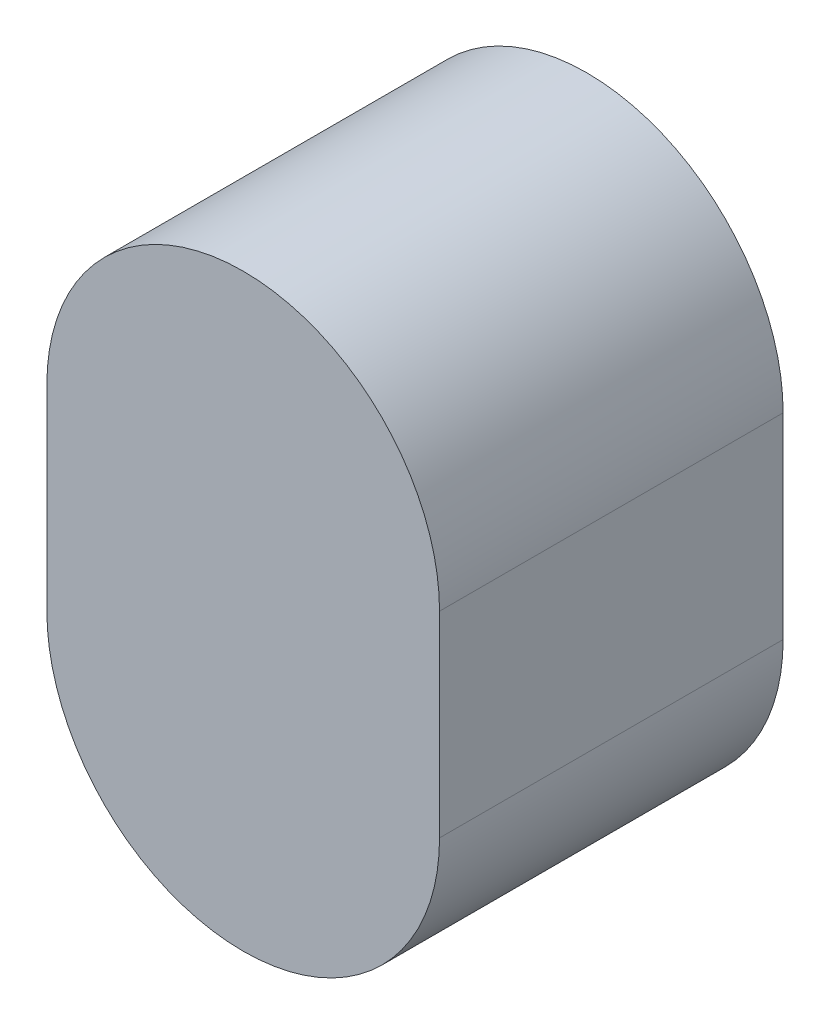
ISO-10303-21;
HEADER;
FILE_DESCRIPTION(('STEP AP214'),'2;1');
FILE_NAME('part.step','',(''),(''),'','','');
FILE_SCHEMA(('AUTOMOTIVE_DESIGN { 1 0 10303 214 1 1 1 1 }'));
ENDSEC;
DATA;
#1=APPLICATION_CONTEXT('core data for automotive mechanical design processes');
#2=APPLICATION_PROTOCOL_DEFINITION('international standard','automotive_design',2000,#1);
#3=PRODUCT_CONTEXT('',#1,'mechanical');
#4=PRODUCT('Part','Part','',(#3));
#5=PRODUCT_RELATED_PRODUCT_CATEGORY('part','',(#4));
#6=PRODUCT_DEFINITION_FORMATION('','',#4);
#7=PRODUCT_DEFINITION_CONTEXT('part definition',#1,'design');
#8=PRODUCT_DEFINITION('design','',#6,#7);
#9=PRODUCT_DEFINITION_SHAPE('','',#8);
#10=(LENGTH_UNIT() NAMED_UNIT(*) SI_UNIT(.MILLI.,.METRE.));
#11=(NAMED_UNIT(*) PLANE_ANGLE_UNIT() SI_UNIT($,.RADIAN.));
#12=(NAMED_UNIT(*) SI_UNIT($,.STERADIAN.) SOLID_ANGLE_UNIT());
#13=UNCERTAINTY_MEASURE_WITH_UNIT(LENGTH_MEASURE(1.E-05),#10,'distance_accuracy_value','');
#14=(GEOMETRIC_REPRESENTATION_CONTEXT(3) GLOBAL_UNCERTAINTY_ASSIGNED_CONTEXT((#13)) GLOBAL_UNIT_ASSIGNED_CONTEXT((#10,
#11,#12)) REPRESENTATION_CONTEXT('',''));
#15=CARTESIAN_POINT('',(0.,0.,0.));
#16=DIRECTION('',(0.,0.,1.));
#17=DIRECTION('',(1.,0.,0.));
#18=AXIS2_PLACEMENT_3D('',#15,#16,#17);
#19=CARTESIAN_POINT('',(4.,0.,7.));
#20=DIRECTION('',(1.,0.,0.));
#21=DIRECTION('',(0.,0.,-1.));
#22=AXIS2_PLACEMENT_3D('',#19,#20,#21);
#23=PLANE('',#22);
#24=DIRECTION('',(0.,-1.,0.));
#25=VECTOR('',#24,1.);
#26=CARTESIAN_POINT('',(4.,0.,0.));
#27=LINE('',#26,#25);
#28=CARTESIAN_POINT('',(4.,0.,0.));
#29=VERTEX_POINT('',#28);
#30=CARTESIAN_POINT('',(4.,-4.,0.));
#31=VERTEX_POINT('',#30);
#32=EDGE_CURVE('E98',#29,#31,#27,.T.);
#33=ORIENTED_EDGE('',*,*,#32,.F.);
#34=DIRECTION('',(0.,0.,-1.));
#35=VECTOR('',#34,1.);
#36=CARTESIAN_POINT('',(4.,0.,7.));
#37=LINE('',#36,#35);
#38=CARTESIAN_POINT('',(4.,0.,7.));
#39=VERTEX_POINT('',#38);
#40=EDGE_CURVE('E11',#39,#29,#37,.T.);
#41=ORIENTED_EDGE('',*,*,#40,.F.);
#42=DIRECTION('',(0.,-1.,0.));
#43=VECTOR('',#42,1.);
#44=CARTESIAN_POINT('',(4.,0.,7.));
#45=LINE('',#44,#43);
#46=CARTESIAN_POINT('',(4.,-4.,7.));
#47=VERTEX_POINT('',#46);
#48=EDGE_CURVE('E93',#39,#47,#45,.T.);
#49=ORIENTED_EDGE('',*,*,#48,.T.);
#50=DIRECTION('',(0.,0.,-1.));
#51=VECTOR('',#50,1.);
#52=CARTESIAN_POINT('',(4.,-4.,7.));
#53=LINE('',#52,#51);
#54=EDGE_CURVE('E36',#47,#31,#53,.T.);
#55=ORIENTED_EDGE('',*,*,#54,.T.);
#56=EDGE_LOOP('',(#33,#41,#49,#55));
#57=FACE_BOUND('',#56,.T.);
#58=ADVANCED_FACE('F33',(#57),#23,.T.);
#59=CARTESIAN_POINT('',(0.,0.,7.));
#60=DIRECTION('',(0.,0.,-1.));
#61=DIRECTION('',(-1.,0.,0.));
#62=AXIS2_PLACEMENT_3D('',#59,#60,#61);
#63=CYLINDRICAL_SURFACE('',#62,4.);
#64=CARTESIAN_POINT('',(0.,0.,0.));
#65=DIRECTION('',(0.,0.,1.));
#66=DIRECTION('',(1.,0.,0.));
#67=AXIS2_PLACEMENT_3D('',#64,#65,#66);
#68=CIRCLE('',#67,4.);
#69=CARTESIAN_POINT('',(-4.,0.,0.));
#70=VERTEX_POINT('',#69);
#71=EDGE_CURVE('E66',#29,#70,#68,.T.);
#72=ORIENTED_EDGE('',*,*,#71,.T.);
#73=DIRECTION('',(0.,0.,-1.));
#74=VECTOR('',#73,1.);
#75=CARTESIAN_POINT('',(-4.,0.,7.));
#76=LINE('',#75,#74);
#77=CARTESIAN_POINT('',(-4.,0.,7.));
#78=VERTEX_POINT('',#77);
#79=EDGE_CURVE('E42',#78,#70,#76,.T.);
#80=ORIENTED_EDGE('',*,*,#79,.F.);
#81=CARTESIAN_POINT('',(0.,0.,7.));
#82=DIRECTION('',(0.,0.,1.));
#83=DIRECTION('',(1.,0.,0.));
#84=AXIS2_PLACEMENT_3D('',#81,#82,#83);
#85=CIRCLE('',#84,4.);
#86=EDGE_CURVE('E81',#39,#78,#85,.T.);
#87=ORIENTED_EDGE('',*,*,#86,.F.);
#88=ORIENTED_EDGE('',*,*,#40,.T.);
#89=EDGE_LOOP('',(#72,#80,#87,#88));
#90=FACE_BOUND('',#89,.T.);
#91=ADVANCED_FACE('F108',(#90),#63,.T.);
#92=CARTESIAN_POINT('',(-4.,0.,7.));
#93=DIRECTION('',(1.,0.,0.));
#94=DIRECTION('',(0.,1.,0.));
#95=AXIS2_PLACEMENT_3D('',#92,#93,#94);
#96=PLANE('',#95);
#97=DIRECTION('',(0.,-1.,0.));
#98=VECTOR('',#97,1.);
#99=CARTESIAN_POINT('',(-4.,0.,0.));
#100=LINE('',#99,#98);
#101=CARTESIAN_POINT('',(-4.,-4.,0.));
#102=VERTEX_POINT('',#101);
#103=EDGE_CURVE('E88',#70,#102,#100,.T.);
#104=ORIENTED_EDGE('',*,*,#103,.T.);
#105=DIRECTION('',(0.,0.,-1.));
#106=VECTOR('',#105,1.);
#107=CARTESIAN_POINT('',(-4.,-4.,7.));
#108=LINE('',#107,#106);
#109=CARTESIAN_POINT('',(-4.,-4.,7.));
#110=VERTEX_POINT('',#109);
#111=EDGE_CURVE('E85',#110,#102,#108,.T.);
#112=ORIENTED_EDGE('',*,*,#111,.F.);
#113=DIRECTION('',(0.,-1.,0.));
#114=VECTOR('',#113,1.);
#115=CARTESIAN_POINT('',(-4.,0.,7.));
#116=LINE('',#115,#114);
#117=EDGE_CURVE('E78',#78,#110,#116,.T.);
#118=ORIENTED_EDGE('',*,*,#117,.F.);
#119=ORIENTED_EDGE('',*,*,#79,.T.);
#120=EDGE_LOOP('',(#104,#112,#118,#119));
#121=FACE_BOUND('',#120,.T.);
#122=ADVANCED_FACE('F86',(#121),#96,.F.);
#123=CARTESIAN_POINT('',(0.,-4.,7.));
#124=DIRECTION('',(0.,0.,-1.));
#125=DIRECTION('',(-1.,0.,0.));
#126=AXIS2_PLACEMENT_3D('',#123,#124,#125);
#127=CYLINDRICAL_SURFACE('',#126,4.);
#128=CARTESIAN_POINT('',(0.,-4.,0.));
#129=DIRECTION('',(0.,0.,1.));
#130=DIRECTION('',(1.,0.,0.));
#131=AXIS2_PLACEMENT_3D('',#128,#129,#130);
#132=CIRCLE('',#131,4.);
#133=EDGE_CURVE('E101',#102,#31,#132,.T.);
#134=ORIENTED_EDGE('',*,*,#133,.T.);
#135=ORIENTED_EDGE('',*,*,#54,.F.);
#136=CARTESIAN_POINT('',(0.,-4.,7.));
#137=DIRECTION('',(0.,0.,1.));
#138=DIRECTION('',(1.,0.,0.));
#139=AXIS2_PLACEMENT_3D('',#136,#137,#138);
#140=CIRCLE('',#139,4.);
#141=EDGE_CURVE('E75',#110,#47,#140,.T.);
#142=ORIENTED_EDGE('',*,*,#141,.F.);
#143=ORIENTED_EDGE('',*,*,#111,.T.);
#144=EDGE_LOOP('',(#134,#135,#142,#143));
#145=FACE_BOUND('',#144,.T.);
#146=ADVANCED_FACE('F92',(#145),#127,.T.);
#147=CARTESIAN_POINT('',(0.,-4.,7.));
#148=DIRECTION('',(0.,0.,1.));
#149=DIRECTION('',(1.,0.,0.));
#150=AXIS2_PLACEMENT_3D('',#147,#148,#149);
#151=PLANE('',#150);
#152=ORIENTED_EDGE('',*,*,#48,.F.);
#153=ORIENTED_EDGE('',*,*,#86,.T.);
#154=ORIENTED_EDGE('',*,*,#117,.T.);
#155=ORIENTED_EDGE('',*,*,#141,.T.);
#156=EDGE_LOOP('',(#152,#153,#154,#155));
#157=FACE_BOUND('',#156,.T.);
#158=ADVANCED_FACE('F80',(#157),#151,.T.);
#159=CARTESIAN_POINT('',(0.,-4.,0.));
#160=DIRECTION('',(0.,0.,1.));
#161=DIRECTION('',(1.,0.,0.));
#162=AXIS2_PLACEMENT_3D('',#159,#160,#161);
#163=PLANE('',#162);
#164=ORIENTED_EDGE('',*,*,#32,.T.);
#165=ORIENTED_EDGE('',*,*,#133,.F.);
#166=ORIENTED_EDGE('',*,*,#103,.F.);
#167=ORIENTED_EDGE('',*,*,#71,.F.);
#168=EDGE_LOOP('',(#164,#165,#166,#167));
#169=FACE_BOUND('',#168,.T.);
#170=ADVANCED_FACE('F106',(#169),#163,.F.);
#171=CLOSED_SHELL('',(#58,#91,#122,#146,#158,#170));
#172=MANIFOLD_SOLID_BREP('B2',#171);
#173=ADVANCED_BREP_SHAPE_REPRESENTATION('',(#18,#172),#14);
#174=SHAPE_DEFINITION_REPRESENTATION(#9,#173);
ENDSEC;
END-ISO-10303-21;
